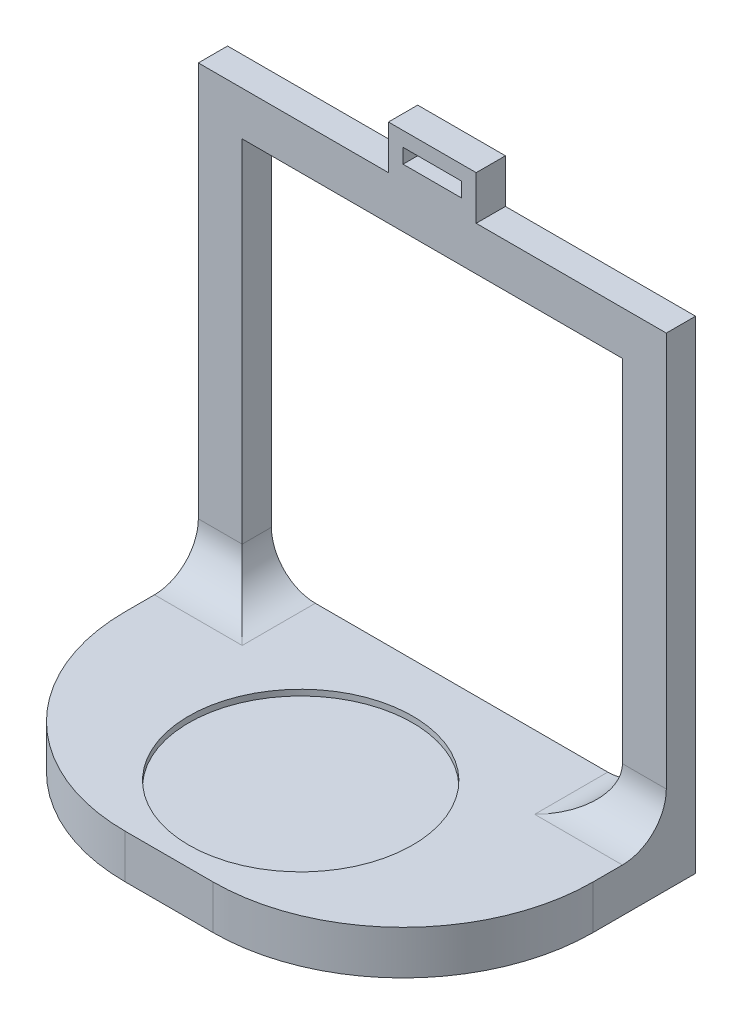
ISO-10303-21;
HEADER;
FILE_DESCRIPTION(('STEP AP214'),'2;1');
FILE_NAME('part.step','',(''),(''),'','','');
FILE_SCHEMA(('AUTOMOTIVE_DESIGN { 1 0 10303 214 1 1 1 1 }'));
ENDSEC;
DATA;
#1=APPLICATION_CONTEXT('core data for automotive mechanical design processes');
#2=APPLICATION_PROTOCOL_DEFINITION('international standard','automotive_design',2000,#1);
#3=PRODUCT_CONTEXT('',#1,'mechanical');
#4=PRODUCT('Part','Part','',(#3));
#5=PRODUCT_RELATED_PRODUCT_CATEGORY('part','',(#4));
#6=PRODUCT_DEFINITION_FORMATION('','',#4);
#7=PRODUCT_DEFINITION_CONTEXT('part definition',#1,'design');
#8=PRODUCT_DEFINITION('design','',#6,#7);
#9=PRODUCT_DEFINITION_SHAPE('','',#8);
#10=(LENGTH_UNIT() NAMED_UNIT(*) SI_UNIT(.MILLI.,.METRE.));
#11=(NAMED_UNIT(*) PLANE_ANGLE_UNIT() SI_UNIT($,.RADIAN.));
#12=(NAMED_UNIT(*) SI_UNIT($,.STERADIAN.) SOLID_ANGLE_UNIT());
#13=UNCERTAINTY_MEASURE_WITH_UNIT(LENGTH_MEASURE(1.E-05),#10,'distance_accuracy_value','');
#14=(GEOMETRIC_REPRESENTATION_CONTEXT(3) GLOBAL_UNCERTAINTY_ASSIGNED_CONTEXT((#13)) GLOBAL_UNIT_ASSIGNED_CONTEXT((#10,
#11,#12)) REPRESENTATION_CONTEXT('',''));
#15=CARTESIAN_POINT('',(0.,0.,0.));
#16=DIRECTION('',(0.,0.,1.));
#17=DIRECTION('',(1.,0.,0.));
#18=AXIS2_PLACEMENT_3D('',#15,#16,#17);
#19=CARTESIAN_POINT('',(0.,0.,10.));
#20=DIRECTION('',(0.,0.,1.));
#21=DIRECTION('',(1.,0.,0.));
#22=AXIS2_PLACEMENT_3D('',#19,#20,#21);
#23=PLANE('',#22);
#24=DIRECTION('',(0.,1.,0.));
#25=VECTOR('',#24,1.);
#26=CARTESIAN_POINT('',(79.9999999999999,-30.,10.));
#27=LINE('',#26,#25);
#28=CARTESIAN_POINT('',(80.,-150.,10.));
#29=VERTEX_POINT('',#28);
#30=CARTESIAN_POINT('',(79.9999999999999,-30.,10.));
#31=VERTEX_POINT('',#30);
#32=EDGE_CURVE('E255',#29,#31,#27,.T.);
#33=ORIENTED_EDGE('',*,*,#32,.F.);
#34=DIRECTION('',(-1.,0.,0.));
#35=VECTOR('',#34,1.);
#36=CARTESIAN_POINT('',(95.,-150.,10.));
#37=LINE('',#36,#35);
#38=CARTESIAN_POINT('',(95.,-150.,10.));
#39=VERTEX_POINT('',#38);
#40=EDGE_CURVE('E374',#29,#39,#37,.F.);
#41=ORIENTED_EDGE('',*,*,#40,.T.);
#42=DIRECTION('',(0.,1.,0.));
#43=VECTOR('',#42,1.);
#44=CARTESIAN_POINT('',(94.9999999999999,-15.,10.));
#45=LINE('',#44,#43);
#46=CARTESIAN_POINT('',(94.9999999999999,-15.,10.));
#47=VERTEX_POINT('',#46);
#48=EDGE_CURVE('E296',#39,#47,#45,.T.);
#49=ORIENTED_EDGE('',*,*,#48,.T.);
#50=DIRECTION('',(-1.,0.,0.));
#51=VECTOR('',#50,1.);
#52=CARTESIAN_POINT('',(30.,-15.,10.));
#53=LINE('',#52,#51);
#54=CARTESIAN_POINT('',(30.,-15.,10.));
#55=VERTEX_POINT('',#54);
#56=EDGE_CURVE('E299',#47,#55,#53,.T.);
#57=ORIENTED_EDGE('',*,*,#56,.T.);
#58=DIRECTION('',(0.,1.,0.));
#59=VECTOR('',#58,1.);
#60=CARTESIAN_POINT('',(30.,0.,10.));
#61=LINE('',#60,#59);
#62=CARTESIAN_POINT('',(30.,0.,10.));
#63=VERTEX_POINT('',#62);
#64=EDGE_CURVE('E302',#55,#63,#61,.T.);
#65=ORIENTED_EDGE('',*,*,#64,.T.);
#66=DIRECTION('',(-1.,0.,0.));
#67=VECTOR('',#66,1.);
#68=CARTESIAN_POINT('',(0.,0.,10.));
#69=LINE('',#68,#67);
#70=CARTESIAN_POINT('',(0.,0.,10.));
#71=VERTEX_POINT('',#70);
#72=EDGE_CURVE('E305',#63,#71,#69,.T.);
#73=ORIENTED_EDGE('',*,*,#72,.T.);
#74=DIRECTION('',(0.,-1.,0.));
#75=VECTOR('',#74,1.);
#76=CARTESIAN_POINT('',(0.,0.,10.));
#77=LINE('',#76,#75);
#78=CARTESIAN_POINT('',(0.,-15.,10.));
#79=VERTEX_POINT('',#78);
#80=EDGE_CURVE('E284',#71,#79,#77,.T.);
#81=ORIENTED_EDGE('',*,*,#80,.T.);
#82=DIRECTION('',(-1.,0.,0.));
#83=VECTOR('',#82,1.);
#84=CARTESIAN_POINT('',(-65.,-15.,10.));
#85=LINE('',#84,#83);
#86=CARTESIAN_POINT('',(-65.,-15.,10.));
#87=VERTEX_POINT('',#86);
#88=EDGE_CURVE('E288',#79,#87,#85,.T.);
#89=ORIENTED_EDGE('',*,*,#88,.T.);
#90=DIRECTION('',(0.,-1.,0.));
#91=VECTOR('',#90,1.);
#92=CARTESIAN_POINT('',(-65.,-15.,10.));
#93=LINE('',#92,#91);
#94=CARTESIAN_POINT('',(-65.,-150.,10.));
#95=VERTEX_POINT('',#94);
#96=EDGE_CURVE('E292',#87,#95,#93,.T.);
#97=ORIENTED_EDGE('',*,*,#96,.T.);
#98=DIRECTION('',(-1.,0.,0.));
#99=VECTOR('',#98,1.);
#100=CARTESIAN_POINT('',(-50.,-150.,10.));
#101=LINE('',#100,#99);
#102=CARTESIAN_POINT('',(-50.,-150.,10.));
#103=VERTEX_POINT('',#102);
#104=EDGE_CURVE('E370',#95,#103,#101,.F.);
#105=ORIENTED_EDGE('',*,*,#104,.T.);
#106=DIRECTION('',(0.,-1.,0.));
#107=VECTOR('',#106,1.);
#108=CARTESIAN_POINT('',(-50.,-30.,10.));
#109=LINE('',#108,#107);
#110=CARTESIAN_POINT('',(-50.,-30.,10.));
#111=VERTEX_POINT('',#110);
#112=EDGE_CURVE('E251',#111,#103,#109,.T.);
#113=ORIENTED_EDGE('',*,*,#112,.F.);
#114=DIRECTION('',(-1.,0.,0.));
#115=VECTOR('',#114,1.);
#116=CARTESIAN_POINT('',(-50.,-30.,10.));
#117=LINE('',#116,#115);
#118=EDGE_CURVE('E259',#31,#111,#117,.T.);
#119=ORIENTED_EDGE('',*,*,#118,.F.);
#120=EDGE_LOOP('',(#33,#41,#49,#57,#65,#73,#81,#89,#97,#105,#113,#119));
#121=FACE_BOUND('',#120,.T.);
#122=DIRECTION('',(1.,0.,0.));
#123=VECTOR('',#122,1.);
#124=CARTESIAN_POINT('',(5.,-10.,10.));
#125=LINE('',#124,#123);
#126=CARTESIAN_POINT('',(5.,-10.,10.));
#127=VERTEX_POINT('',#126);
#128=CARTESIAN_POINT('',(25.,-10.,10.));
#129=VERTEX_POINT('',#128);
#130=EDGE_CURVE('E207',#127,#129,#125,.T.);
#131=ORIENTED_EDGE('',*,*,#130,.F.);
#132=DIRECTION('',(0.,-1.,0.));
#133=VECTOR('',#132,1.);
#134=CARTESIAN_POINT('',(5.,-5.,10.));
#135=LINE('',#134,#133);
#136=CARTESIAN_POINT('',(5.,-5.,10.));
#137=VERTEX_POINT('',#136);
#138=EDGE_CURVE('E196',#137,#127,#135,.T.);
#139=ORIENTED_EDGE('',*,*,#138,.F.);
#140=DIRECTION('',(-1.,0.,0.));
#141=VECTOR('',#140,1.);
#142=CARTESIAN_POINT('',(5.,-5.,10.));
#143=LINE('',#142,#141);
#144=CARTESIAN_POINT('',(25.,-5.,10.));
#145=VERTEX_POINT('',#144);
#146=EDGE_CURVE('E225',#145,#137,#143,.T.);
#147=ORIENTED_EDGE('',*,*,#146,.F.);
#148=DIRECTION('',(0.,1.,0.));
#149=VECTOR('',#148,1.);
#150=CARTESIAN_POINT('',(25.,-5.,10.));
#151=LINE('',#150,#149);
#152=EDGE_CURVE('E221',#129,#145,#151,.T.);
#153=ORIENTED_EDGE('',*,*,#152,.F.);
#154=EDGE_LOOP('',(#131,#139,#147,#153));
#155=FACE_BOUND('',#154,.T.);
#156=ADVANCED_FACE('F39',(#121,#155),#23,.T.);
#157=CARTESIAN_POINT('',(0.,0.,0.));
#158=DIRECTION('',(0.,0.,1.));
#159=DIRECTION('',(1.,0.,0.));
#160=AXIS2_PLACEMENT_3D('',#157,#158,#159);
#161=PLANE('',#160);
#162=DIRECTION('',(0.,-1.,0.));
#163=VECTOR('',#162,1.);
#164=CARTESIAN_POINT('',(-50.,-30.,0.));
#165=LINE('',#164,#163);
#166=CARTESIAN_POINT('',(-50.,-30.,0.));
#167=VERTEX_POINT('',#166);
#168=CARTESIAN_POINT('',(-50.,-150.,0.));
#169=VERTEX_POINT('',#168);
#170=EDGE_CURVE('E216',#167,#169,#165,.T.);
#171=ORIENTED_EDGE('',*,*,#170,.T.);
#172=CARTESIAN_POINT('',(-35.,-150.,0.));
#173=DIRECTION('',(0.,0.,1.));
#174=DIRECTION('',(1.,0.,0.));
#175=AXIS2_PLACEMENT_3D('',#172,#173,#174);
#176=CIRCLE('',#175,15.);
#177=CARTESIAN_POINT('',(-35.,-165.,0.));
#178=VERTEX_POINT('',#177);
#179=EDGE_CURVE('E399',#169,#178,#176,.T.);
#180=ORIENTED_EDGE('',*,*,#179,.T.);
#181=DIRECTION('',(1.,0.,0.));
#182=VECTOR('',#181,1.);
#183=CARTESIAN_POINT('',(-50.,-165.,0.));
#184=LINE('',#183,#182);
#185=CARTESIAN_POINT('',(65.,-165.,0.));
#186=VERTEX_POINT('',#185);
#187=EDGE_CURVE('E266',#178,#186,#184,.T.);
#188=ORIENTED_EDGE('',*,*,#187,.T.);
#189=CARTESIAN_POINT('',(65.,-150.,0.));
#190=DIRECTION('',(0.,0.,1.));
#191=DIRECTION('',(1.,0.,0.));
#192=AXIS2_PLACEMENT_3D('',#189,#190,#191);
#193=CIRCLE('',#192,15.);
#194=CARTESIAN_POINT('',(80.,-150.,0.));
#195=VERTEX_POINT('',#194);
#196=EDGE_CURVE('E405',#186,#195,#193,.T.);
#197=ORIENTED_EDGE('',*,*,#196,.T.);
#198=DIRECTION('',(0.,1.,0.));
#199=VECTOR('',#198,1.);
#200=CARTESIAN_POINT('',(79.9999999999999,-30.,0.));
#201=LINE('',#200,#199);
#202=CARTESIAN_POINT('',(79.9999999999999,-30.,0.));
#203=VERTEX_POINT('',#202);
#204=EDGE_CURVE('E270',#195,#203,#201,.T.);
#205=ORIENTED_EDGE('',*,*,#204,.T.);
#206=DIRECTION('',(-1.,0.,0.));
#207=VECTOR('',#206,1.);
#208=CARTESIAN_POINT('',(-50.,-30.,0.));
#209=LINE('',#208,#207);
#210=EDGE_CURVE('E256',#203,#167,#209,.T.);
#211=ORIENTED_EDGE('',*,*,#210,.T.);
#212=EDGE_LOOP('',(#171,#180,#188,#197,#205,#211));
#213=FACE_BOUND('',#212,.T.);
#214=DIRECTION('',(0.,-1.,0.));
#215=VECTOR('',#214,1.);
#216=CARTESIAN_POINT('',(0.,0.,0.));
#217=LINE('',#216,#215);
#218=CARTESIAN_POINT('',(0.,0.,0.));
#219=VERTEX_POINT('',#218);
#220=CARTESIAN_POINT('',(0.,-15.,0.));
#221=VERTEX_POINT('',#220);
#222=EDGE_CURVE('E283',#219,#221,#217,.T.);
#223=ORIENTED_EDGE('',*,*,#222,.F.);
#224=DIRECTION('',(-1.,0.,0.));
#225=VECTOR('',#224,1.);
#226=CARTESIAN_POINT('',(0.,0.,0.));
#227=LINE('',#226,#225);
#228=CARTESIAN_POINT('',(30.,0.,0.));
#229=VERTEX_POINT('',#228);
#230=EDGE_CURVE('E289',#229,#219,#227,.T.);
#231=ORIENTED_EDGE('',*,*,#230,.F.);
#232=DIRECTION('',(0.,1.,0.));
#233=VECTOR('',#232,1.);
#234=CARTESIAN_POINT('',(30.,0.,0.));
#235=LINE('',#234,#233);
#236=CARTESIAN_POINT('',(30.,-15.,0.));
#237=VERTEX_POINT('',#236);
#238=EDGE_CURVE('E329',#237,#229,#235,.T.);
#239=ORIENTED_EDGE('',*,*,#238,.F.);
#240=DIRECTION('',(-1.,0.,0.));
#241=VECTOR('',#240,1.);
#242=CARTESIAN_POINT('',(30.,-15.,0.));
#243=LINE('',#242,#241);
#244=CARTESIAN_POINT('',(94.9999999999999,-15.,0.));
#245=VERTEX_POINT('',#244);
#246=EDGE_CURVE('E326',#245,#237,#243,.T.);
#247=ORIENTED_EDGE('',*,*,#246,.F.);
#248=DIRECTION('',(0.,1.,0.));
#249=VECTOR('',#248,1.);
#250=CARTESIAN_POINT('',(94.9999999999999,-15.,0.));
#251=LINE('',#250,#249);
#252=CARTESIAN_POINT('',(95.,-180.,0.));
#253=VERTEX_POINT('',#252);
#254=EDGE_CURVE('E323',#253,#245,#251,.T.);
#255=ORIENTED_EDGE('',*,*,#254,.F.);
#256=DIRECTION('',(1.,0.,0.));
#257=VECTOR('',#256,1.);
#258=CARTESIAN_POINT('',(-65.,-180.,0.));
#259=LINE('',#258,#257);
#260=CARTESIAN_POINT('',(-65.,-180.,0.));
#261=VERTEX_POINT('',#260);
#262=EDGE_CURVE('E319',#261,#253,#259,.T.);
#263=ORIENTED_EDGE('',*,*,#262,.F.);
#264=DIRECTION('',(0.,-1.,0.));
#265=VECTOR('',#264,1.);
#266=CARTESIAN_POINT('',(-65.,-15.,0.));
#267=LINE('',#266,#265);
#268=CARTESIAN_POINT('',(-65.,-15.,0.));
#269=VERTEX_POINT('',#268);
#270=EDGE_CURVE('E315',#269,#261,#267,.T.);
#271=ORIENTED_EDGE('',*,*,#270,.F.);
#272=DIRECTION('',(-1.,0.,0.));
#273=VECTOR('',#272,1.);
#274=CARTESIAN_POINT('',(-65.,-15.,0.));
#275=LINE('',#274,#273);
#276=EDGE_CURVE('E312',#221,#269,#275,.T.);
#277=ORIENTED_EDGE('',*,*,#276,.F.);
#278=EDGE_LOOP('',(#223,#231,#239,#247,#255,#263,#271,#277));
#279=FACE_BOUND('',#278,.T.);
#280=DIRECTION('',(0.,-1.,0.));
#281=VECTOR('',#280,1.);
#282=CARTESIAN_POINT('',(5.,-5.,0.));
#283=LINE('',#282,#281);
#284=CARTESIAN_POINT('',(5.,-5.,0.));
#285=VERTEX_POINT('',#284);
#286=CARTESIAN_POINT('',(5.,-10.,0.));
#287=VERTEX_POINT('',#286);
#288=EDGE_CURVE('E231',#285,#287,#283,.T.);
#289=ORIENTED_EDGE('',*,*,#288,.T.);
#290=DIRECTION('',(1.,0.,0.));
#291=VECTOR('',#290,1.);
#292=CARTESIAN_POINT('',(5.,-10.,0.));
#293=LINE('',#292,#291);
#294=CARTESIAN_POINT('',(25.,-10.,0.));
#295=VERTEX_POINT('',#294);
#296=EDGE_CURVE('E214',#287,#295,#293,.T.);
#297=ORIENTED_EDGE('',*,*,#296,.T.);
#298=DIRECTION('',(0.,1.,0.));
#299=VECTOR('',#298,1.);
#300=CARTESIAN_POINT('',(25.,-5.,0.));
#301=LINE('',#300,#299);
#302=CARTESIAN_POINT('',(25.,-5.,0.));
#303=VERTEX_POINT('',#302);
#304=EDGE_CURVE('E237',#295,#303,#301,.T.);
#305=ORIENTED_EDGE('',*,*,#304,.T.);
#306=DIRECTION('',(-1.,0.,0.));
#307=VECTOR('',#306,1.);
#308=CARTESIAN_POINT('',(5.,-5.,0.));
#309=LINE('',#308,#307);
#310=EDGE_CURVE('E208',#303,#285,#309,.T.);
#311=ORIENTED_EDGE('',*,*,#310,.T.);
#312=EDGE_LOOP('',(#289,#297,#305,#311));
#313=FACE_BOUND('',#312,.T.);
#314=ADVANCED_FACE('F490',(#213,#279,#313),#161,.F.);
#315=CARTESIAN_POINT('',(0.,0.,10.));
#316=DIRECTION('',(1.,0.,0.));
#317=DIRECTION('',(0.,1.,0.));
#318=AXIS2_PLACEMENT_3D('',#315,#316,#317);
#319=PLANE('',#318);
#320=ORIENTED_EDGE('',*,*,#222,.T.);
#321=DIRECTION('',(0.,0.,-1.));
#322=VECTOR('',#321,1.);
#323=CARTESIAN_POINT('',(0.,-15.,10.));
#324=LINE('',#323,#322);
#325=EDGE_CURVE('E359',#79,#221,#324,.T.);
#326=ORIENTED_EDGE('',*,*,#325,.F.);
#327=ORIENTED_EDGE('',*,*,#80,.F.);
#328=DIRECTION('',(0.,0.,-1.));
#329=VECTOR('',#328,1.);
#330=CARTESIAN_POINT('',(0.,0.,10.));
#331=LINE('',#330,#329);
#332=EDGE_CURVE('E308',#71,#219,#331,.T.);
#333=ORIENTED_EDGE('',*,*,#332,.T.);
#334=EDGE_LOOP('',(#320,#326,#327,#333));
#335=FACE_BOUND('',#334,.T.);
#336=ADVANCED_FACE('F496',(#335),#319,.F.);
#337=CARTESIAN_POINT('',(-65.,-15.,10.));
#338=DIRECTION('',(0.,-1.,0.));
#339=DIRECTION('',(0.,0.,-1.));
#340=AXIS2_PLACEMENT_3D('',#337,#338,#339);
#341=PLANE('',#340);
#342=ORIENTED_EDGE('',*,*,#276,.T.);
#343=DIRECTION('',(0.,0.,-1.));
#344=VECTOR('',#343,1.);
#345=CARTESIAN_POINT('',(-65.,-15.,10.));
#346=LINE('',#345,#344);
#347=EDGE_CURVE('E355',#87,#269,#346,.T.);
#348=ORIENTED_EDGE('',*,*,#347,.F.);
#349=ORIENTED_EDGE('',*,*,#88,.F.);
#350=ORIENTED_EDGE('',*,*,#325,.T.);
#351=EDGE_LOOP('',(#342,#348,#349,#350));
#352=FACE_BOUND('',#351,.T.);
#353=ADVANCED_FACE('F519',(#352),#341,.F.);
#354=CARTESIAN_POINT('',(-65.,-15.,10.));
#355=DIRECTION('',(1.,0.,0.));
#356=DIRECTION('',(0.,1.,0.));
#357=AXIS2_PLACEMENT_3D('',#354,#355,#356);
#358=PLANE('',#357);
#359=DIRECTION('',(0.,0.,-1.));
#360=VECTOR('',#359,1.);
#361=CARTESIAN_POINT('',(-65.,-180.,10.));
#362=LINE('',#361,#360);
#363=CARTESIAN_POINT('',(-65.,-180.,35.));
#364=VERTEX_POINT('',#363);
#365=EDGE_CURVE('E352',#364,#261,#362,.T.);
#366=ORIENTED_EDGE('',*,*,#365,.F.);
#367=DIRECTION('',(0.,-1.,0.));
#368=VECTOR('',#367,1.);
#369=CARTESIAN_POINT('',(-65.,-15.,35.));
#370=LINE('',#369,#368);
#371=CARTESIAN_POINT('',(-65.,-165.,35.));
#372=VERTEX_POINT('',#371);
#373=EDGE_CURVE('E11',#364,#372,#370,.F.);
#374=ORIENTED_EDGE('',*,*,#373,.T.);
#375=DIRECTION('',(0.,0.,-1.));
#376=VECTOR('',#375,1.);
#377=CARTESIAN_POINT('',(-65.,-165.,100.));
#378=LINE('',#377,#376);
#379=CARTESIAN_POINT('',(-65.,-165.,25.));
#380=VERTEX_POINT('',#379);
#381=EDGE_CURVE('E453',#372,#380,#378,.T.);
#382=ORIENTED_EDGE('',*,*,#381,.T.);
#383=CARTESIAN_POINT('',(-65.,-150.,25.));
#384=DIRECTION('',(1.,0.,0.));
#385=DIRECTION('',(0.,1.,0.));
#386=AXIS2_PLACEMENT_3D('',#383,#384,#385);
#387=CIRCLE('',#386,15.);
#388=EDGE_CURVE('E381',#380,#95,#387,.T.);
#389=ORIENTED_EDGE('',*,*,#388,.T.);
#390=ORIENTED_EDGE('',*,*,#96,.F.);
#391=ORIENTED_EDGE('',*,*,#347,.T.);
#392=ORIENTED_EDGE('',*,*,#270,.T.);
#393=EDGE_LOOP('',(#366,#374,#382,#389,#390,#391,#392));
#394=FACE_BOUND('',#393,.T.);
#395=ADVANCED_FACE('F516',(#394),#358,.F.);
#396=CARTESIAN_POINT('',(-65.,-180.,10.));
#397=DIRECTION('',(0.,1.,0.));
#398=DIRECTION('',(0.,0.,1.));
#399=AXIS2_PLACEMENT_3D('',#396,#397,#398);
#400=PLANE('',#399);
#401=DIRECTION('',(0.,0.,-1.));
#402=VECTOR('',#401,1.);
#403=CARTESIAN_POINT('',(95.,-180.,10.));
#404=LINE('',#403,#402);
#405=CARTESIAN_POINT('',(95.,-180.,35.));
#406=VERTEX_POINT('',#405);
#407=EDGE_CURVE('E349',#406,#253,#404,.T.);
#408=ORIENTED_EDGE('',*,*,#407,.F.);
#409=CARTESIAN_POINT('',(30.,-180.,35.));
#410=DIRECTION('',(0.,1.,0.));
#411=DIRECTION('',(0.,0.,1.));
#412=AXIS2_PLACEMENT_3D('',#409,#410,#411);
#413=CIRCLE('',#412,65.);
#414=CARTESIAN_POINT('',(30.,-180.,100.));
#415=VERTEX_POINT('',#414);
#416=EDGE_CURVE('E48',#406,#415,#413,.F.);
#417=ORIENTED_EDGE('',*,*,#416,.T.);
#418=DIRECTION('',(1.,0.,0.));
#419=VECTOR('',#418,1.);
#420=CARTESIAN_POINT('',(-65.,-180.,100.));
#421=LINE('',#420,#419);
#422=CARTESIAN_POINT('',(0.,-180.,100.));
#423=VERTEX_POINT('',#422);
#424=EDGE_CURVE('E433',#423,#415,#421,.T.);
#425=ORIENTED_EDGE('',*,*,#424,.F.);
#426=CARTESIAN_POINT('',(0.,-180.,35.));
#427=DIRECTION('',(0.,1.,0.));
#428=DIRECTION('',(0.,0.,1.));
#429=AXIS2_PLACEMENT_3D('',#426,#427,#428);
#430=CIRCLE('',#429,65.);
#431=EDGE_CURVE('E55',#423,#364,#430,.F.);
#432=ORIENTED_EDGE('',*,*,#431,.T.);
#433=ORIENTED_EDGE('',*,*,#365,.T.);
#434=ORIENTED_EDGE('',*,*,#262,.T.);
#435=EDGE_LOOP('',(#408,#417,#425,#432,#433,#434));
#436=FACE_BOUND('',#435,.T.);
#437=ADVANCED_FACE('F432',(#436),#400,.F.);
#438=CARTESIAN_POINT('',(94.9999999999999,-15.,10.));
#439=DIRECTION('',(-1.,0.,0.));
#440=DIRECTION('',(0.,-1.,0.));
#441=AXIS2_PLACEMENT_3D('',#438,#439,#440);
#442=PLANE('',#441);
#443=DIRECTION('',(0.,0.,-1.));
#444=VECTOR('',#443,1.);
#445=CARTESIAN_POINT('',(95.,-165.,100.));
#446=LINE('',#445,#444);
#447=CARTESIAN_POINT('',(95.,-165.,35.));
#448=VERTEX_POINT('',#447);
#449=CARTESIAN_POINT('',(95.,-165.,25.));
#450=VERTEX_POINT('',#449);
#451=EDGE_CURVE('E234',#448,#450,#446,.T.);
#452=ORIENTED_EDGE('',*,*,#451,.F.);
#453=DIRECTION('',(0.,1.,0.));
#454=VECTOR('',#453,1.);
#455=CARTESIAN_POINT('',(94.9999999999999,-15.,35.));
#456=LINE('',#455,#454);
#457=EDGE_CURVE('E63',#448,#406,#456,.F.);
#458=ORIENTED_EDGE('',*,*,#457,.T.);
#459=ORIENTED_EDGE('',*,*,#407,.T.);
#460=ORIENTED_EDGE('',*,*,#254,.T.);
#461=DIRECTION('',(0.,0.,-1.));
#462=VECTOR('',#461,1.);
#463=CARTESIAN_POINT('',(94.9999999999999,-15.,10.));
#464=LINE('',#463,#462);
#465=EDGE_CURVE('E345',#47,#245,#464,.T.);
#466=ORIENTED_EDGE('',*,*,#465,.F.);
#467=ORIENTED_EDGE('',*,*,#48,.F.);
#468=CARTESIAN_POINT('',(95.,-150.,25.));
#469=DIRECTION('',(-1.,0.,0.));
#470=DIRECTION('',(0.,-1.,0.));
#471=AXIS2_PLACEMENT_3D('',#468,#469,#470);
#472=CIRCLE('',#471,15.);
#473=EDGE_CURVE('E377',#39,#450,#472,.T.);
#474=ORIENTED_EDGE('',*,*,#473,.T.);
#475=EDGE_LOOP('',(#452,#458,#459,#460,#466,#467,#474));
#476=FACE_BOUND('',#475,.T.);
#477=ADVANCED_FACE('F448',(#476),#442,.F.);
#478=CARTESIAN_POINT('',(30.,-15.,10.));
#479=DIRECTION('',(0.,-1.,0.));
#480=DIRECTION('',(1.,0.,0.));
#481=AXIS2_PLACEMENT_3D('',#478,#479,#480);
#482=PLANE('',#481);
#483=ORIENTED_EDGE('',*,*,#246,.T.);
#484=DIRECTION('',(0.,0.,-1.));
#485=VECTOR('',#484,1.);
#486=CARTESIAN_POINT('',(30.,-15.,10.));
#487=LINE('',#486,#485);
#488=EDGE_CURVE('E341',#55,#237,#487,.T.);
#489=ORIENTED_EDGE('',*,*,#488,.F.);
#490=ORIENTED_EDGE('',*,*,#56,.F.);
#491=ORIENTED_EDGE('',*,*,#465,.T.);
#492=EDGE_LOOP('',(#483,#489,#490,#491));
#493=FACE_BOUND('',#492,.T.);
#494=ADVANCED_FACE('F507',(#493),#482,.F.);
#495=CARTESIAN_POINT('',(30.,0.,10.));
#496=DIRECTION('',(-1.,0.,0.));
#497=DIRECTION('',(0.,-1.,0.));
#498=AXIS2_PLACEMENT_3D('',#495,#496,#497);
#499=PLANE('',#498);
#500=ORIENTED_EDGE('',*,*,#238,.T.);
#501=DIRECTION('',(0.,0.,-1.));
#502=VECTOR('',#501,1.);
#503=CARTESIAN_POINT('',(30.,0.,10.));
#504=LINE('',#503,#502);
#505=EDGE_CURVE('E337',#63,#229,#504,.T.);
#506=ORIENTED_EDGE('',*,*,#505,.F.);
#507=ORIENTED_EDGE('',*,*,#64,.F.);
#508=ORIENTED_EDGE('',*,*,#488,.T.);
#509=EDGE_LOOP('',(#500,#506,#507,#508));
#510=FACE_BOUND('',#509,.T.);
#511=ADVANCED_FACE('F503',(#510),#499,.F.);
#512=CARTESIAN_POINT('',(0.,0.,10.));
#513=DIRECTION('',(0.,-1.,0.));
#514=DIRECTION('',(0.,0.,-1.));
#515=AXIS2_PLACEMENT_3D('',#512,#513,#514);
#516=PLANE('',#515);
#517=ORIENTED_EDGE('',*,*,#230,.T.);
#518=ORIENTED_EDGE('',*,*,#332,.F.);
#519=ORIENTED_EDGE('',*,*,#72,.F.);
#520=ORIENTED_EDGE('',*,*,#505,.T.);
#521=EDGE_LOOP('',(#517,#518,#519,#520));
#522=FACE_BOUND('',#521,.T.);
#523=ADVANCED_FACE('F486',(#522),#516,.F.);
#524=CARTESIAN_POINT('',(-50.,-30.,10.));
#525=DIRECTION('',(1.,0.,0.));
#526=DIRECTION('',(0.,1.,0.));
#527=AXIS2_PLACEMENT_3D('',#524,#525,#526);
#528=PLANE('',#527);
#529=ORIENTED_EDGE('',*,*,#112,.T.);
#530=DIRECTION('',(0.,0.,-1.));
#531=VECTOR('',#530,1.);
#532=CARTESIAN_POINT('',(-50.,-150.,0.));
#533=LINE('',#532,#531);
#534=EDGE_CURVE('E384',#103,#169,#533,.T.);
#535=ORIENTED_EDGE('',*,*,#534,.T.);
#536=ORIENTED_EDGE('',*,*,#170,.F.);
#537=DIRECTION('',(0.,0.,-1.));
#538=VECTOR('',#537,1.);
#539=CARTESIAN_POINT('',(-50.,-30.,10.));
#540=LINE('',#539,#538);
#541=EDGE_CURVE('E262',#111,#167,#540,.T.);
#542=ORIENTED_EDGE('',*,*,#541,.F.);
#543=EDGE_LOOP('',(#529,#535,#536,#542));
#544=FACE_BOUND('',#543,.T.);
#545=ADVANCED_FACE('F477',(#544),#528,.T.);
#546=CARTESIAN_POINT('',(-50.,-165.,10.));
#547=DIRECTION('',(0.,1.,0.));
#548=DIRECTION('',(0.,0.,1.));
#549=AXIS2_PLACEMENT_3D('',#546,#547,#548);
#550=PLANE('',#549);
#551=CARTESIAN_POINT('',(15.,-165.,55.));
#552=DIRECTION('',(0.,1.,0.));
#553=DIRECTION('',(0.,0.,1.));
#554=AXIS2_PLACEMENT_3D('',#551,#552,#553);
#555=CIRCLE('',#554,38.25);
#556=CARTESIAN_POINT('',(15.,-165.,93.25));
#557=VERTEX_POINT('',#556);
#558=EDGE_CURVE('E459',#557,#557,#555,.T.);
#559=ORIENTED_EDGE('',*,*,#558,.F.);
#560=EDGE_LOOP('',(#559));
#561=FACE_BOUND('',#560,.T.);
#562=DIRECTION('',(-1.,0.,0.));
#563=VECTOR('',#562,1.);
#564=CARTESIAN_POINT('',(-65.,-165.,100.));
#565=LINE('',#564,#563);
#566=CARTESIAN_POINT('',(30.,-165.,100.));
#567=VERTEX_POINT('',#566);
#568=CARTESIAN_POINT('',(0.,-165.,100.));
#569=VERTEX_POINT('',#568);
#570=EDGE_CURVE('E442',#567,#569,#565,.T.);
#571=ORIENTED_EDGE('',*,*,#570,.F.);
#572=CARTESIAN_POINT('',(30.,-165.,35.));
#573=DIRECTION('',(0.,1.,0.));
#574=DIRECTION('',(0.,0.,1.));
#575=AXIS2_PLACEMENT_3D('',#572,#573,#574);
#576=CIRCLE('',#575,65.);
#577=EDGE_CURVE('E423',#567,#448,#576,.T.);
#578=ORIENTED_EDGE('',*,*,#577,.T.);
#579=ORIENTED_EDGE('',*,*,#451,.T.);
#580=DIRECTION('',(-1.,0.,0.));
#581=VECTOR('',#580,1.);
#582=CARTESIAN_POINT('',(80.,-165.,25.));
#583=LINE('',#582,#581);
#584=CARTESIAN_POINT('',(65.,-165.,25.));
#585=VERTEX_POINT('',#584);
#586=EDGE_CURVE('E367',#450,#585,#583,.T.);
#587=ORIENTED_EDGE('',*,*,#586,.T.);
#588=DIRECTION('',(0.,0.,-1.));
#589=VECTOR('',#588,1.);
#590=CARTESIAN_POINT('',(65.,-165.,0.));
#591=LINE('',#590,#589);
#592=EDGE_CURVE('E388',#585,#186,#591,.T.);
#593=ORIENTED_EDGE('',*,*,#592,.T.);
#594=ORIENTED_EDGE('',*,*,#187,.F.);
#595=DIRECTION('',(0.,0.,-1.));
#596=VECTOR('',#595,1.);
#597=CARTESIAN_POINT('',(-35.,-165.,25.));
#598=LINE('',#597,#596);
#599=CARTESIAN_POINT('',(-35.,-165.,25.));
#600=VERTEX_POINT('',#599);
#601=EDGE_CURVE('E392',#178,#600,#598,.F.);
#602=ORIENTED_EDGE('',*,*,#601,.T.);
#603=DIRECTION('',(-1.,0.,0.));
#604=VECTOR('',#603,1.);
#605=CARTESIAN_POINT('',(-65.,-165.,25.));
#606=LINE('',#605,#604);
#607=EDGE_CURVE('E363',#600,#380,#606,.T.);
#608=ORIENTED_EDGE('',*,*,#607,.T.);
#609=ORIENTED_EDGE('',*,*,#381,.F.);
#610=CARTESIAN_POINT('',(0.,-165.,35.));
#611=DIRECTION('',(0.,1.,0.));
#612=DIRECTION('',(0.,0.,1.));
#613=AXIS2_PLACEMENT_3D('',#610,#611,#612);
#614=CIRCLE('',#613,65.);
#615=EDGE_CURVE('E420',#372,#569,#614,.T.);
#616=ORIENTED_EDGE('',*,*,#615,.T.);
#617=EDGE_LOOP('',(#571,#578,#579,#587,#593,#594,#602,#608,#609,#616));
#618=FACE_BOUND('',#617,.T.);
#619=ADVANCED_FACE('F447',(#561,#618),#550,.T.);
#620=CARTESIAN_POINT('',(79.9999999999999,-30.,10.));
#621=DIRECTION('',(-1.,0.,0.));
#622=DIRECTION('',(0.,-1.,0.));
#623=AXIS2_PLACEMENT_3D('',#620,#621,#622);
#624=PLANE('',#623);
#625=ORIENTED_EDGE('',*,*,#204,.F.);
#626=DIRECTION('',(0.,0.,-1.));
#627=VECTOR('',#626,1.);
#628=CARTESIAN_POINT('',(80.,-150.,25.));
#629=LINE('',#628,#627);
#630=EDGE_CURVE('E396',#195,#29,#629,.F.);
#631=ORIENTED_EDGE('',*,*,#630,.T.);
#632=ORIENTED_EDGE('',*,*,#32,.T.);
#633=DIRECTION('',(0.,0.,-1.));
#634=VECTOR('',#633,1.);
#635=CARTESIAN_POINT('',(79.9999999999999,-30.,10.));
#636=LINE('',#635,#634);
#637=EDGE_CURVE('E279',#31,#203,#636,.T.);
#638=ORIENTED_EDGE('',*,*,#637,.T.);
#639=EDGE_LOOP('',(#625,#631,#632,#638));
#640=FACE_BOUND('',#639,.T.);
#641=ADVANCED_FACE('F476',(#640),#624,.T.);
#642=CARTESIAN_POINT('',(-50.,-30.,10.));
#643=DIRECTION('',(0.,-1.,0.));
#644=DIRECTION('',(0.,0.,-1.));
#645=AXIS2_PLACEMENT_3D('',#642,#643,#644);
#646=PLANE('',#645);
#647=ORIENTED_EDGE('',*,*,#210,.F.);
#648=ORIENTED_EDGE('',*,*,#637,.F.);
#649=ORIENTED_EDGE('',*,*,#118,.T.);
#650=ORIENTED_EDGE('',*,*,#541,.T.);
#651=EDGE_LOOP('',(#647,#648,#649,#650));
#652=FACE_BOUND('',#651,.T.);
#653=ADVANCED_FACE('F483',(#652),#646,.T.);
#654=CARTESIAN_POINT('',(5.,-5.,10.));
#655=DIRECTION('',(1.,0.,0.));
#656=DIRECTION('',(0.,1.,0.));
#657=AXIS2_PLACEMENT_3D('',#654,#655,#656);
#658=PLANE('',#657);
#659=ORIENTED_EDGE('',*,*,#288,.F.);
#660=DIRECTION('',(0.,0.,-1.));
#661=VECTOR('',#660,1.);
#662=CARTESIAN_POINT('',(5.,-5.,10.));
#663=LINE('',#662,#661);
#664=EDGE_CURVE('E202',#137,#285,#663,.T.);
#665=ORIENTED_EDGE('',*,*,#664,.F.);
#666=ORIENTED_EDGE('',*,*,#138,.T.);
#667=DIRECTION('',(0.,0.,-1.));
#668=VECTOR('',#667,1.);
#669=CARTESIAN_POINT('',(5.,-10.,10.));
#670=LINE('',#669,#668);
#671=EDGE_CURVE('E199',#127,#287,#670,.T.);
#672=ORIENTED_EDGE('',*,*,#671,.T.);
#673=EDGE_LOOP('',(#659,#665,#666,#672));
#674=FACE_BOUND('',#673,.T.);
#675=ADVANCED_FACE('F198',(#674),#658,.T.);
#676=CARTESIAN_POINT('',(5.,-10.,10.));
#677=DIRECTION('',(0.,1.,0.));
#678=DIRECTION('',(-1.,0.,0.));
#679=AXIS2_PLACEMENT_3D('',#676,#677,#678);
#680=PLANE('',#679);
#681=ORIENTED_EDGE('',*,*,#296,.F.);
#682=ORIENTED_EDGE('',*,*,#671,.F.);
#683=ORIENTED_EDGE('',*,*,#130,.T.);
#684=DIRECTION('',(0.,0.,-1.));
#685=VECTOR('',#684,1.);
#686=CARTESIAN_POINT('',(25.,-10.,10.));
#687=LINE('',#686,#685);
#688=EDGE_CURVE('E217',#129,#295,#687,.T.);
#689=ORIENTED_EDGE('',*,*,#688,.T.);
#690=EDGE_LOOP('',(#681,#682,#683,#689));
#691=FACE_BOUND('',#690,.T.);
#692=ADVANCED_FACE('F211',(#691),#680,.T.);
#693=CARTESIAN_POINT('',(25.,-5.,10.));
#694=DIRECTION('',(-1.,0.,0.));
#695=DIRECTION('',(0.,0.,1.));
#696=AXIS2_PLACEMENT_3D('',#693,#694,#695);
#697=PLANE('',#696);
#698=ORIENTED_EDGE('',*,*,#304,.F.);
#699=ORIENTED_EDGE('',*,*,#688,.F.);
#700=ORIENTED_EDGE('',*,*,#152,.T.);
#701=DIRECTION('',(0.,0.,-1.));
#702=VECTOR('',#701,1.);
#703=CARTESIAN_POINT('',(25.,-5.,10.));
#704=LINE('',#703,#702);
#705=EDGE_CURVE('E246',#145,#303,#704,.T.);
#706=ORIENTED_EDGE('',*,*,#705,.T.);
#707=EDGE_LOOP('',(#698,#699,#700,#706));
#708=FACE_BOUND('',#707,.T.);
#709=ADVANCED_FACE('F594',(#708),#697,.T.);
#710=CARTESIAN_POINT('',(5.,-5.,10.));
#711=DIRECTION('',(0.,-1.,0.));
#712=DIRECTION('',(1.,0.,0.));
#713=AXIS2_PLACEMENT_3D('',#710,#711,#712);
#714=PLANE('',#713);
#715=ORIENTED_EDGE('',*,*,#310,.F.);
#716=ORIENTED_EDGE('',*,*,#705,.F.);
#717=ORIENTED_EDGE('',*,*,#146,.T.);
#718=ORIENTED_EDGE('',*,*,#664,.T.);
#719=EDGE_LOOP('',(#715,#716,#717,#718));
#720=FACE_BOUND('',#719,.T.);
#721=ADVANCED_FACE('F591',(#720),#714,.T.);
#722=CARTESIAN_POINT('',(0.,0.,100.));
#723=DIRECTION('',(0.,0.,-1.));
#724=DIRECTION('',(-1.,0.,0.));
#725=AXIS2_PLACEMENT_3D('',#722,#723,#724);
#726=PLANE('',#725);
#727=ORIENTED_EDGE('',*,*,#424,.T.);
#728=DIRECTION('',(0.,1.,0.));
#729=VECTOR('',#728,1.);
#730=CARTESIAN_POINT('',(29.9999999999999,0.,100.));
#731=LINE('',#730,#729);
#732=EDGE_CURVE('E416',#415,#567,#731,.T.);
#733=ORIENTED_EDGE('',*,*,#732,.T.);
#734=ORIENTED_EDGE('',*,*,#570,.T.);
#735=DIRECTION('',(0.,-1.,0.));
#736=VECTOR('',#735,1.);
#737=CARTESIAN_POINT('',(0.,0.,100.));
#738=LINE('',#737,#736);
#739=EDGE_CURVE('E412',#569,#423,#738,.T.);
#740=ORIENTED_EDGE('',*,*,#739,.T.);
#741=EDGE_LOOP('',(#727,#733,#734,#740));
#742=FACE_BOUND('',#741,.T.);
#743=ADVANCED_FACE('F437',(#742),#726,.F.);
#744=CARTESIAN_POINT('',(15.,-167.,55.));
#745=DIRECTION('',(0.,1.,0.));
#746=DIRECTION('',(0.,0.,1.));
#747=AXIS2_PLACEMENT_3D('',#744,#745,#746);
#748=CYLINDRICAL_SURFACE('',#747,38.25);
#749=CARTESIAN_POINT('',(15.,-167.,55.));
#750=DIRECTION('',(0.,1.,0.));
#751=DIRECTION('',(0.,0.,1.));
#752=AXIS2_PLACEMENT_3D('',#749,#750,#751);
#753=CIRCLE('',#752,38.25);
#754=CARTESIAN_POINT('',(15.,-167.,93.25));
#755=VERTEX_POINT('',#754);
#756=EDGE_CURVE('E443',#755,#755,#753,.T.);
#757=ORIENTED_EDGE('',*,*,#756,.F.);
#758=EDGE_LOOP('',(#757));
#759=FACE_BOUND('',#758,.T.);
#760=ORIENTED_EDGE('',*,*,#558,.T.);
#761=EDGE_LOOP('',(#760));
#762=FACE_BOUND('',#761,.T.);
#763=ADVANCED_FACE('F469',(#759,#762),#748,.F.);
#764=CARTESIAN_POINT('',(15.,-167.,55.));
#765=DIRECTION('',(0.,1.,0.));
#766=DIRECTION('',(0.,0.,1.));
#767=AXIS2_PLACEMENT_3D('',#764,#765,#766);
#768=PLANE('',#767);
#769=ORIENTED_EDGE('',*,*,#756,.T.);
#770=EDGE_LOOP('',(#769));
#771=FACE_BOUND('',#770,.T.);
#772=ADVANCED_FACE('F467',(#771),#768,.T.);
#773=CARTESIAN_POINT('',(-50.,-150.,25.));
#774=DIRECTION('',(1.,0.,0.));
#775=DIRECTION('',(0.,0.,-1.));
#776=AXIS2_PLACEMENT_3D('',#773,#774,#775);
#777=CYLINDRICAL_SURFACE('',#776,15.);
#778=ORIENTED_EDGE('',*,*,#473,.F.);
#779=ORIENTED_EDGE('',*,*,#40,.F.);
#780=CARTESIAN_POINT('',(65.,-150.,25.));
#781=DIRECTION('',(0.707106781186547,0.,0.707106781186547));
#782=DIRECTION('',(0.707106781186547,0.,-0.707106781186547));
#783=AXIS2_PLACEMENT_3D('',#780,#781,#782);
#784=ELLIPSE('',#783,21.2132034355964,15.);
#785=EDGE_CURVE('E408',#29,#585,#784,.F.);
#786=ORIENTED_EDGE('',*,*,#785,.T.);
#787=ORIENTED_EDGE('',*,*,#586,.F.);
#788=EDGE_LOOP('',(#778,#779,#786,#787));
#789=FACE_BOUND('',#788,.T.);
#790=ADVANCED_FACE('F527',(#789),#777,.F.);
#791=CARTESIAN_POINT('',(-50.,-150.,25.));
#792=DIRECTION('',(1.,0.,0.));
#793=DIRECTION('',(0.,0.,-1.));
#794=AXIS2_PLACEMENT_3D('',#791,#792,#793);
#795=CYLINDRICAL_SURFACE('',#794,15.);
#796=ORIENTED_EDGE('',*,*,#607,.F.);
#797=CARTESIAN_POINT('',(-35.,-150.,25.));
#798=DIRECTION('',(0.707106781186547,0.,-0.707106781186547));
#799=DIRECTION('',(0.707106781186547,0.,0.707106781186547));
#800=AXIS2_PLACEMENT_3D('',#797,#798,#799);
#801=ELLIPSE('',#800,21.2132034355964,15.);
#802=EDGE_CURVE('E402',#600,#103,#801,.T.);
#803=ORIENTED_EDGE('',*,*,#802,.T.);
#804=ORIENTED_EDGE('',*,*,#104,.F.);
#805=ORIENTED_EDGE('',*,*,#388,.F.);
#806=EDGE_LOOP('',(#796,#803,#804,#805));
#807=FACE_BOUND('',#806,.T.);
#808=ADVANCED_FACE('F530',(#807),#795,.F.);
#809=CARTESIAN_POINT('',(-35.,-150.,10.));
#810=DIRECTION('',(0.,0.,1.));
#811=DIRECTION('',(1.,0.,0.));
#812=AXIS2_PLACEMENT_3D('',#809,#810,#811);
#813=CYLINDRICAL_SURFACE('',#812,15.);
#814=ORIENTED_EDGE('',*,*,#802,.F.);
#815=ORIENTED_EDGE('',*,*,#601,.F.);
#816=ORIENTED_EDGE('',*,*,#179,.F.);
#817=ORIENTED_EDGE('',*,*,#534,.F.);
#818=EDGE_LOOP('',(#814,#815,#816,#817));
#819=FACE_BOUND('',#818,.T.);
#820=ADVANCED_FACE('F534',(#819),#813,.F.);
#821=CARTESIAN_POINT('',(65.,-150.,10.));
#822=DIRECTION('',(0.,0.,1.));
#823=DIRECTION('',(1.,0.,0.));
#824=AXIS2_PLACEMENT_3D('',#821,#822,#823);
#825=CYLINDRICAL_SURFACE('',#824,15.);
#826=ORIENTED_EDGE('',*,*,#785,.F.);
#827=ORIENTED_EDGE('',*,*,#630,.F.);
#828=ORIENTED_EDGE('',*,*,#196,.F.);
#829=ORIENTED_EDGE('',*,*,#592,.F.);
#830=EDGE_LOOP('',(#826,#827,#828,#829));
#831=FACE_BOUND('',#830,.T.);
#832=ADVANCED_FACE('F538',(#831),#825,.F.);
#833=CARTESIAN_POINT('',(29.9999999999999,0.,35.));
#834=DIRECTION('',(0.,1.,0.));
#835=DIRECTION('',(-1.,0.,0.));
#836=AXIS2_PLACEMENT_3D('',#833,#834,#835);
#837=CYLINDRICAL_SURFACE('',#836,65.);
#838=ORIENTED_EDGE('',*,*,#416,.F.);
#839=ORIENTED_EDGE('',*,*,#457,.F.);
#840=ORIENTED_EDGE('',*,*,#577,.F.);
#841=ORIENTED_EDGE('',*,*,#732,.F.);
#842=EDGE_LOOP('',(#838,#839,#840,#841));
#843=FACE_BOUND('',#842,.T.);
#844=ADVANCED_FACE('F445',(#843),#837,.T.);
#845=CARTESIAN_POINT('',(0.,0.,35.));
#846=DIRECTION('',(0.,-1.,0.));
#847=DIRECTION('',(1.,0.,0.));
#848=AXIS2_PLACEMENT_3D('',#845,#846,#847);
#849=CYLINDRICAL_SURFACE('',#848,65.);
#850=ORIENTED_EDGE('',*,*,#615,.F.);
#851=ORIENTED_EDGE('',*,*,#373,.F.);
#852=ORIENTED_EDGE('',*,*,#431,.F.);
#853=ORIENTED_EDGE('',*,*,#739,.F.);
#854=EDGE_LOOP('',(#850,#851,#852,#853));
#855=FACE_BOUND('',#854,.T.);
#856=ADVANCED_FACE('F41',(#855),#849,.T.);
#857=CLOSED_SHELL('',(#156,#314,#336,#353,#395,#437,#477,#494,#511,#523,#545,#619,#641,#653,
#675,#692,#709,#721,#743,#763,#772,#790,#808,#820,#832,#844,#856));
#858=MANIFOLD_SOLID_BREP('B2',#857);
#859=ADVANCED_BREP_SHAPE_REPRESENTATION('',(#18,#858),#14);
#860=SHAPE_DEFINITION_REPRESENTATION(#9,#859);
ENDSEC;
END-ISO-10303-21;
